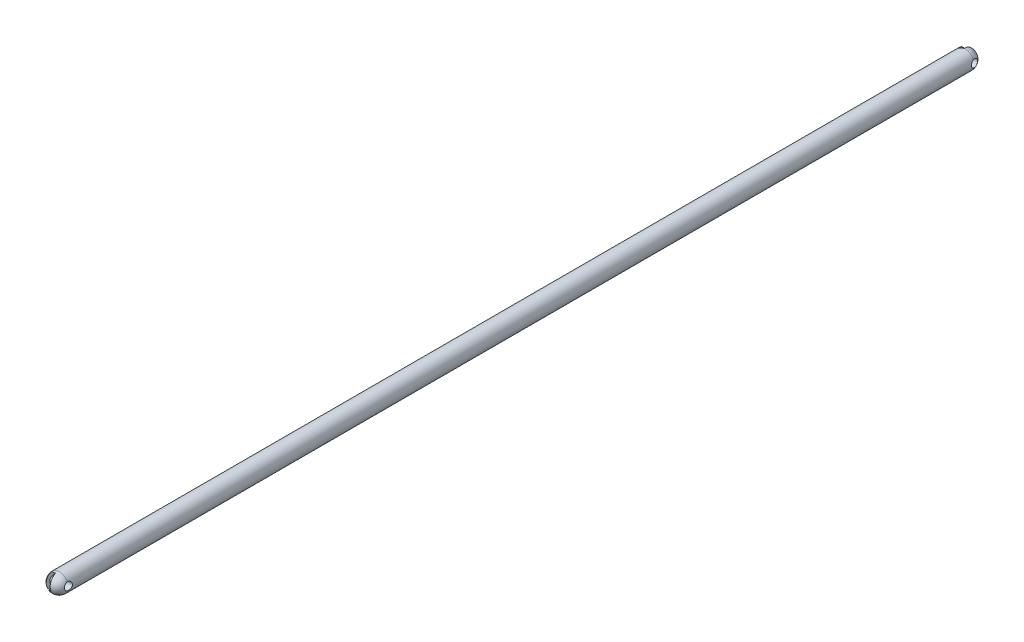
ISO-10303-21;
HEADER;
FILE_DESCRIPTION(('STEP AP214'),'2;1');
FILE_NAME('part.step','',(''),(''),'','','');
FILE_SCHEMA(('AUTOMOTIVE_DESIGN { 1 0 10303 214 1 1 1 1 }'));
ENDSEC;
DATA;
#1=APPLICATION_CONTEXT('core data for automotive mechanical design processes');
#2=APPLICATION_PROTOCOL_DEFINITION('international standard','automotive_design',2000,#1);
#3=PRODUCT_CONTEXT('',#1,'mechanical');
#4=PRODUCT('Part','Part','',(#3));
#5=PRODUCT_RELATED_PRODUCT_CATEGORY('part','',(#4));
#6=PRODUCT_DEFINITION_FORMATION('','',#4);
#7=PRODUCT_DEFINITION_CONTEXT('part definition',#1,'design');
#8=PRODUCT_DEFINITION('design','',#6,#7);
#9=PRODUCT_DEFINITION_SHAPE('','',#8);
#10=(LENGTH_UNIT() NAMED_UNIT(*) SI_UNIT(.MILLI.,.METRE.));
#11=(NAMED_UNIT(*) PLANE_ANGLE_UNIT() SI_UNIT($,.RADIAN.));
#12=(NAMED_UNIT(*) SI_UNIT($,.STERADIAN.) SOLID_ANGLE_UNIT());
#13=UNCERTAINTY_MEASURE_WITH_UNIT(LENGTH_MEASURE(1.E-05),#10,'distance_accuracy_value','');
#14=(GEOMETRIC_REPRESENTATION_CONTEXT(3) GLOBAL_UNCERTAINTY_ASSIGNED_CONTEXT((#13)) GLOBAL_UNIT_ASSIGNED_CONTEXT((#10,
#11,#12)) REPRESENTATION_CONTEXT('',''));
#15=CARTESIAN_POINT('',(0.,0.,0.));
#16=DIRECTION('',(0.,0.,1.));
#17=DIRECTION('',(1.,0.,0.));
#18=AXIS2_PLACEMENT_3D('',#15,#16,#17);
#19=CARTESIAN_POINT('',(0.,0.,-487.405602584974));
#20=DIRECTION('',(0.,0.,1.));
#21=DIRECTION('',(1.,0.,0.));
#22=AXIS2_PLACEMENT_3D('',#19,#20,#21);
#23=SPHERICAL_SURFACE('',#22,5.);
#24=CARTESIAN_POINT('',(0.,0.,-487.405602584974));
#25=DIRECTION('',(0.,0.,1.));
#26=DIRECTION('',(1.,0.,0.));
#27=AXIS2_PLACEMENT_3D('',#24,#25,#26);
#28=CIRCLE('',#27,5.);
#29=CARTESIAN_POINT('',(-4.56594007018859,-2.03769263517494,-487.405602584974));
#30=VERTEX_POINT('',#29);
#31=CARTESIAN_POINT('',(-2.91527036137964,-4.06216675187779,-487.405602584974));
#32=VERTEX_POINT('',#31);
#33=EDGE_CURVE('E157',#30,#32,#28,.T.);
#34=ORIENTED_EDGE('',*,*,#33,.F.);
#35=CARTESIAN_POINT('',(-4.54438160156836,-0.122994973257826,-486.828135619789));
#36=DIRECTION('',(0.991665365521505,0.0268397035739624,-0.126013622823728));
#37=DIRECTION('',(-0.126059035557744,0.,-0.99202274145014));
#38=AXIS2_PLACEMENT_3D('',#35,#36,#37);
#39=CIRCLE('',#38,2.00000000000004);
#40=CARTESIAN_POINT('',(-4.66947630984865,1.787733478951,-487.405602584974));
#41=VERTEX_POINT('',#40);
#42=EDGE_CURVE('E239',#30,#41,#39,.T.);
#43=ORIENTED_EDGE('',*,*,#42,.T.);
#44=CARTESIAN_POINT('',(-3.13072887232831,3.89853007272869,-487.405602584974));
#45=VERTEX_POINT('',#44);
#46=EDGE_CURVE('E164',#45,#41,#28,.T.);
#47=ORIENTED_EDGE('',*,*,#46,.F.);
#48=CARTESIAN_POINT('',(-2.97499609656448,-0.0805191107218875,-487.027561716503));
#49=DIRECTION('',(-0.991665365521505,-0.0268397035739629,0.126013622823729));
#50=DIRECTION('',(0.126059035557745,0.,0.99202274145014));
#51=AXIS2_PLACEMENT_3D('',#48,#49,#50);
#52=CIRCLE('',#51,4.00000000000003);
#53=EDGE_CURVE('E145',#45,#32,#52,.T.);
#54=ORIENTED_EDGE('',*,*,#53,.T.);
#55=EDGE_LOOP('',(#34,#43,#47,#54));
#56=FACE_BOUND('',#55,.T.);
#57=ADVANCED_FACE('F39',(#56),#23,.T.);
#58=CARTESIAN_POINT('',(0.,0.,0.));
#59=DIRECTION('',(0.,0.,1.));
#60=DIRECTION('',(1.,0.,0.));
#61=AXIS2_PLACEMENT_3D('',#58,#59,#60);
#62=SPHERICAL_SURFACE('',#61,5.);
#63=CARTESIAN_POINT('',(-4.56133184862588,-0.401408342217977,0.181997553579467));
#64=DIRECTION('',(0.99536421267338,0.0875944815619359,-0.0397151221702364));
#65=DIRECTION('',(-0.0876636443807125,0.99615013198508,0.));
#66=AXIS2_PLACEMENT_3D('',#63,#64,#65);
#67=CIRCLE('',#66,2.);
#68=CARTESIAN_POINT('',(-4.39393905679713,-2.38606361297279,0.));
#69=VERTEX_POINT('',#68);
#70=CARTESIAN_POINT('',(-4.74313646679556,1.58197865262275,0.));
#71=VERTEX_POINT('',#70);
#72=EDGE_CURVE('E54',#69,#71,#67,.F.);
#73=ORIENTED_EDGE('',*,*,#72,.F.);
#74=CARTESIAN_POINT('',(0.,0.,0.));
#75=DIRECTION('',(0.,0.,1.));
#76=DIRECTION('',(1.,0.,0.));
#77=AXIS2_PLACEMENT_3D('',#74,#75,#76);
#78=CIRCLE('',#77,5.);
#79=CARTESIAN_POINT('',(-2.64031127333073,-4.24602830653808,0.));
#80=VERTEX_POINT('',#79);
#81=EDGE_CURVE('E137',#69,#80,#78,.T.);
#82=ORIENTED_EDGE('',*,*,#81,.T.);
#83=CARTESIAN_POINT('',(-2.98609263802015,-0.262783444685808,0.11914536651071));
#84=DIRECTION('',(-0.995364212673381,-0.0875944815619359,0.0397151221702365));
#85=DIRECTION('',(0.0876636443807125,-0.99615013198508,0.));
#86=AXIS2_PLACEMENT_3D('',#83,#84,#85);
#87=CIRCLE('',#86,4.);
#88=CARTESIAN_POINT('',(-3.31622642739424,3.69699231489883,0.578696903249891));
#89=VERTEX_POINT('',#88);
#90=EDGE_CURVE('E195',#89,#80,#87,.F.);
#91=ORIENTED_EDGE('',*,*,#90,.F.);
#92=CARTESIAN_POINT('',(-0.283684245813847,2.44778637118254,-1.71110056096374));
#93=DIRECTION('',(-0.0945614152712806,0.815928790394163,-0.570366853654567));
#94=DIRECTION('',(0.,0.572934154513705,0.819601399822905));
#95=AXIS2_PLACEMENT_3D('',#92,#93,#94);
#96=CIRCLE('',#95,3.99999999999996);
#97=CARTESIAN_POINT('',(-0.353909354826916,4.73369946071433,1.57061694381502));
#98=VERTEX_POINT('',#97);
#99=EDGE_CURVE('E201',#98,#89,#96,.F.);
#100=ORIENTED_EDGE('',*,*,#99,.F.);
#101=CARTESIAN_POINT('',(0.,0.,0.));
#102=DIRECTION('',(0.99536421267338,0.0875944815619359,-0.0397151221702364));
#103=DIRECTION('',(-0.0876636443807125,0.99615013198508,0.));
#104=AXIS2_PLACEMENT_3D('',#101,#102,#103);
#105=CIRCLE('',#104,5.);
#106=CARTESIAN_POINT('',(0.348372623472996,-1.86038420688369,4.62791606643771));
#107=VERTEX_POINT('',#106);
#108=EDGE_CURVE('E205',#107,#98,#105,.F.);
#109=ORIENTED_EDGE('',*,*,#108,.F.);
#110=CARTESIAN_POINT('',(0.396259002636022,-3.41914434947975,2.39011863260942));
#111=DIRECTION('',(0.0945614152712805,-0.815928790394163,0.570366853654567));
#112=DIRECTION('',(0.,-0.572934154513705,-0.819601399822905));
#113=AXIS2_PLACEMENT_3D('',#110,#111,#112);
#114=CIRCLE('',#113,2.72759301258525);
#115=CARTESIAN_POINT('',(0.444145381799037,-4.9779044920758,0.152321198781133));
#116=VERTEX_POINT('',#115);
#117=EDGE_CURVE('E11',#116,#107,#114,.F.);
#118=ORIENTED_EDGE('',*,*,#117,.F.);
#119=CARTESIAN_POINT('',(0.438318221903555,-4.9807506599254,0.));
#120=VERTEX_POINT('',#119);
#121=EDGE_CURVE('E425',#120,#116,#105,.F.);
#122=ORIENTED_EDGE('',*,*,#121,.F.);
#123=CARTESIAN_POINT('',(4.74313646679558,-1.58197865262271,0.));
#124=VERTEX_POINT('',#123);
#125=EDGE_CURVE('E147',#120,#124,#78,.T.);
#126=ORIENTED_EDGE('',*,*,#125,.T.);
#127=CARTESIAN_POINT('',(4.56133184862589,0.401408342217992,-0.181997553579587));
#128=DIRECTION('',(-0.99536421267338,-0.0875944815619359,0.0397151221702364));
#129=DIRECTION('',(0.0876636443807125,-0.99615013198508,0.));
#130=AXIS2_PLACEMENT_3D('',#127,#128,#129);
#131=CIRCLE('',#130,2.);
#132=CARTESIAN_POINT('',(4.39393905679712,2.38606361297281,0.));
#133=VERTEX_POINT('',#132);
#134=EDGE_CURVE('E61',#133,#124,#131,.F.);
#135=ORIENTED_EDGE('',*,*,#134,.F.);
#136=EDGE_CURVE('E139',#133,#71,#78,.T.);
#137=ORIENTED_EDGE('',*,*,#136,.T.);
#138=EDGE_LOOP('',(#73,#82,#91,#100,#109,#118,#122,#126,#135,#137));
#139=FACE_BOUND('',#138,.T.);
#140=ADVANCED_FACE('F135',(#139),#62,.T.);
#141=CARTESIAN_POINT('',(4.56594007018862,2.03769263517488,-487.405602584974));
#142=VERTEX_POINT('',#141);
#143=CARTESIAN_POINT('',(-0.135276875983171,4.99816968167591,-487.405602584974));
#144=VERTEX_POINT('',#143);
#145=EDGE_CURVE('E153',#142,#144,#28,.T.);
#146=ORIENTED_EDGE('',*,*,#145,.F.);
#147=CARTESIAN_POINT('',(4.5443816015683,0.122994973257891,-487.98306955016));
#148=DIRECTION('',(-0.991665365521505,-0.0268397035739624,0.126013622823728));
#149=DIRECTION('',(0.126059035557744,0.,0.99202274145014));
#150=AXIS2_PLACEMENT_3D('',#147,#148,#149);
#151=CIRCLE('',#150,2.00000000000004);
#152=CARTESIAN_POINT('',(4.66947630984872,-1.78773347895082,-487.405602584974));
#153=VERTEX_POINT('',#152);
#154=EDGE_CURVE('E216',#142,#153,#151,.T.);
#155=ORIENTED_EDGE('',*,*,#154,.T.);
#156=CARTESIAN_POINT('',(0.135276875983353,-4.9981696816759,-487.405602584974));
#157=VERTEX_POINT('',#156);
#158=EDGE_CURVE('E156',#157,#153,#28,.T.);
#159=ORIENTED_EDGE('',*,*,#158,.F.);
#160=CARTESIAN_POINT('',(0.,0.,-487.405602584974));
#161=DIRECTION('',(0.991665365521505,0.0268397035739626,-0.126013622823729));
#162=DIRECTION('',(-0.126059035557745,0.,-0.99202274145014));
#163=AXIS2_PLACEMENT_3D('',#160,#161,#162);
#164=CIRCLE('',#163,5.);
#165=EDGE_CURVE('E149',#157,#144,#164,.T.);
#166=ORIENTED_EDGE('',*,*,#165,.T.);
#167=EDGE_LOOP('',(#146,#155,#159,#166));
#168=FACE_BOUND('',#167,.T.);
#169=ADVANCED_FACE('F41',(#168),#23,.T.);
#170=CARTESIAN_POINT('',(0.,0.,0.));
#171=DIRECTION('',(0.,0.,-1.));
#172=DIRECTION('',(-1.,0.,0.));
#173=AXIS2_PLACEMENT_3D('',#170,#171,#172);
#174=CYLINDRICAL_SURFACE('',#173,5.);
#175=ORIENTED_EDGE('',*,*,#46,.T.);
#176=CARTESIAN_POINT('',(-4.66947630984865,1.787733478951,-487.405602584974));
#177=CARTESIAN_POINT('',(-4.66351751317325,1.80328195546211,-487.355473092111));
#178=CARTESIAN_POINT('',(-4.65826103640564,1.81679400936569,-487.304629087359));
#179=CARTESIAN_POINT('',(-4.64927275894143,1.83968170775629,-487.201893178683));
#180=CARTESIAN_POINT('',(-4.64554076565082,1.84905787475813,-487.150001407997));
#181=CARTESIAN_POINT('',(-4.63973047718485,1.86358780811257,-487.045727606933));
#182=CARTESIAN_POINT('',(-4.63764623531151,1.8687567602249,-486.993348036214));
#183=CARTESIAN_POINT('',(-4.63515230222582,1.87493223416605,-486.888319543519));
#184=CARTESIAN_POINT('',(-4.63474257878847,1.87593883609654,-486.835670626746));
#185=CARTESIAN_POINT('',(-4.63603452526098,1.87275762874213,-486.677886868902));
#186=CARTESIAN_POINT('',(-4.64025233272072,1.86238105140578,-486.572825428322));
#187=CARTESIAN_POINT('',(-4.6547229912429,1.82590224888449,-486.365942960298));
#188=CARTESIAN_POINT('',(-4.66497942118177,1.7997906979253,-486.264123892245));
#189=CARTESIAN_POINT('',(-4.69065990126826,1.73178319679889,-486.062391362308));
#190=CARTESIAN_POINT('',(-4.70625908793918,1.68934532994847,-485.962683489418));
#191=CARTESIAN_POINT('',(-4.7406892204886,1.59016189668879,-485.771245737522));
#192=CARTESIAN_POINT('',(-4.75952199661809,1.53340821877521,-485.679520421289));
#193=CARTESIAN_POINT('',(-4.80035161172534,1.40067713951199,-485.49737909481));
#194=CARTESIAN_POINT('',(-4.82247799646655,1.32336621154518,-485.407959718229));
#195=CARTESIAN_POINT('',(-4.86563610993325,1.15462593128934,-485.243221061638));
#196=CARTESIAN_POINT('',(-4.88666759047015,1.06319339644084,-485.167904968545));
#197=CARTESIAN_POINT('',(-4.92528877283284,0.866965479426091,-485.033143651348));
#198=CARTESIAN_POINT('',(-4.94283629287156,0.762029033332818,-484.973890095212));
#199=CARTESIAN_POINT('',(-4.97171887294017,0.542423329086382,-484.875234363489));
#200=CARTESIAN_POINT('',(-4.98305988580725,0.427763519257526,-484.835813169062));
#201=CARTESIAN_POINT('',(-4.99694922611202,0.20433946911744,-484.781973297842));
#202=CARTESIAN_POINT('',(-5.00026244955644,0.0961297601014254,-484.765451106508));
#203=CARTESIAN_POINT('',(-4.99970541637261,-0.121481400245741,-484.751315278202));
#204=CARTESIAN_POINT('',(-4.99583886948166,-0.230882207110427,-484.75369187844));
#205=CARTESIAN_POINT('',(-4.98175298934448,-0.438247597508656,-484.776213895401));
#206=CARTESIAN_POINT('',(-4.97208022211072,-0.536414676295768,-484.794887227491));
#207=CARTESIAN_POINT('',(-4.94765738414017,-0.728024260712353,-484.847117990362));
#208=CARTESIAN_POINT('',(-4.93290669777691,-0.821466191907856,-484.880677225993));
#209=CARTESIAN_POINT('',(-4.89901850453265,-1.00425422637426,-484.962533425387));
#210=CARTESIAN_POINT('',(-4.87976198907509,-1.09339146910079,-485.011244787776));
#211=CARTESIAN_POINT('',(-4.83869283265533,-1.26279950117306,-485.121332128271));
#212=CARTESIAN_POINT('',(-4.81687919760099,-1.34306681857967,-485.182713038825));
#213=CARTESIAN_POINT('',(-4.77003311903697,-1.5014332155063,-485.323539478201));
#214=CARTESIAN_POINT('',(-4.74490321931283,-1.57841935684434,-485.404205156059));
#215=CARTESIAN_POINT('',(-4.69587811870043,-1.71879882583968,-485.576990863495));
#216=CARTESIAN_POINT('',(-4.67198372399268,-1.78218336118087,-485.669118241704));
#217=CARTESIAN_POINT('',(-4.6261216523557,-1.89820487208058,-485.870046688439));
#218=CARTESIAN_POINT('',(-4.60442843898899,-1.94969560083364,-485.979577695616));
#219=CARTESIAN_POINT('',(-4.56795212546234,-2.03369928159624,-486.206804677417));
#220=CARTESIAN_POINT('',(-4.55316665000801,-2.06621875801753,-486.324497829396));
#221=CARTESIAN_POINT('',(-4.53325809591743,-2.10953097064869,-486.558967555699));
#222=CARTESIAN_POINT('',(-4.5277195228876,-2.1212595390714,-486.675534485442));
#223=CARTESIAN_POINT('',(-4.52607769363093,-2.12476871092717,-486.908967726996));
#224=CARTESIAN_POINT('',(-4.52995777838248,-2.11658453448331,-487.025833145532));
#225=CARTESIAN_POINT('',(-4.54162730566508,-2.09133066048903,-487.1855789469));
#226=CARTESIAN_POINT('',(-4.54560315134113,-2.08269395096339,-487.230222496817));
#227=CARTESIAN_POINT('',(-4.55483567155301,-2.06242525409225,-487.318611810533));
#228=CARTESIAN_POINT('',(-4.56009022416777,-2.05079822716209,-487.36235893282));
#229=CARTESIAN_POINT('',(-4.56594007018861,-2.03769263517491,-487.405602584974));
#230=B_SPLINE_CURVE_WITH_KNOTS('',3,(#176,#177,#178,#179,#180,#181,#182,#183,#184,#185,#186,
#187,#188,#189,#190,#191,#192,#193,#194,#195,#196,#197,#198,#199,#200,#201,#202,#203,#204,#205,
#206,#207,#208,#209,#210,#211,#212,#213,#214,#215,#216,#217,#218,#219,#220,#221,#222,#223,#224,
#225,#226,#227,#228,#229),.UNSPECIFIED.,.F.,.F.,(4,2,2,2,2,2,2,2,2,2,2,2,2,2,2,2,2,2,2,2,2,2,2,
2,2,2,4),(0.,0.158418322446994,0.31681662508936,0.474640628420281,0.632461594518664,
0.947835339339043,1.26339618335958,1.59048803308853,1.91776563480118,2.27690183016923,
2.63611908179547,2.99945084876743,3.3624335204407,3.6891714537465,4.0157406108142,
4.31554797677452,4.61539170298165,4.92428897830402,5.23330673962141,5.57477666127415,
5.91646665453489,6.28350674654473,6.65042053510757,7.00035413891046,7.34966925729409,
7.48650444645409,7.62311409768893),.UNSPECIFIED.);
#231=EDGE_CURVE('E233',#41,#30,#230,.T.);
#232=ORIENTED_EDGE('',*,*,#231,.T.);
#233=ORIENTED_EDGE('',*,*,#33,.T.);
#234=CARTESIAN_POINT('',(0.,0.,-463.598652726891));
#235=DIRECTION('',(-0.991665365521505,-0.0268397035739629,0.126013622823729));
#236=DIRECTION('',(-0.125967493815141,-0.00340934584538545,-0.992028511113889));
#237=AXIS2_PLACEMENT_3D('',#234,#235,#236);
#238=ELLIPSE('',#237,39.6782497634729,5.);
#239=CARTESIAN_POINT('',(-1.98935735714231,-4.5872058276891,-480.230950000838));
#240=VERTEX_POINT('',#239);
#241=EDGE_CURVE('E179',#32,#240,#238,.T.);
#242=ORIENTED_EDGE('',*,*,#241,.T.);
#243=CARTESIAN_POINT('',(0.,0.,-483.709390197709));
#244=DIRECTION('',(0.0875096655632501,0.577529080928381,0.811666322521163));
#245=DIRECTION('',(0.121599125553052,0.802505994855964,-0.584121375131036));
#246=AXIS2_PLACEMENT_3D('',#243,#244,#245);
#247=ELLIPSE('',#246,6.16016688294916,5.);
#248=CARTESIAN_POINT('',(1.0303732803339,-4.89268136129611,-480.339165176914));
#249=VERTEX_POINT('',#248);
#250=EDGE_CURVE('E175',#240,#249,#247,.T.);
#251=ORIENTED_EDGE('',*,*,#250,.T.);
#252=CARTESIAN_POINT('',(0.,0.,-487.405602584975));
#253=DIRECTION('',(0.991665365521505,0.0268397035739626,-0.126013622823729));
#254=DIRECTION('',(-0.125967493815142,-0.00340934584538543,-0.992028511113889));
#255=AXIS2_PLACEMENT_3D('',#252,#253,#254);
#256=ELLIPSE('',#255,39.6782497634728,5.);
#257=EDGE_CURVE('E171',#249,#157,#256,.T.);
#258=ORIENTED_EDGE('',*,*,#257,.T.);
#259=ORIENTED_EDGE('',*,*,#158,.T.);
#260=CARTESIAN_POINT('',(4.66947630984872,-1.78773347895082,-487.405602584974));
#261=CARTESIAN_POINT('',(4.67568062088382,-1.77151669899013,-487.353282404624));
#262=CARTESIAN_POINT('',(4.68263791042543,-1.75310333172486,-487.3017671715));
#263=CARTESIAN_POINT('',(4.69780826903366,-1.71204161116034,-487.2006691208));
#264=CARTESIAN_POINT('',(4.70602081149726,-1.68939503289125,-487.151085503769));
#265=CARTESIAN_POINT('',(4.73211610901038,-1.61548687082584,-487.005979490226));
#266=CARTESIAN_POINT('',(4.75150197850632,-1.55814476426868,-486.913743133287));
#267=CARTESIAN_POINT('',(4.79187881096462,-1.42914215538673,-486.740571421566));
#268=CARTESIAN_POINT('',(4.81286806265096,-1.3574967905573,-486.659624271684));
#269=CARTESIAN_POINT('',(4.85410959173953,-1.2017107084323,-486.510484915751));
#270=CARTESIAN_POINT('',(4.8743614431976,-1.11756290757257,-486.442299990267));
#271=CARTESIAN_POINT('',(4.91255154712641,-0.935810689459344,-486.318079116466));
#272=CARTESIAN_POINT('',(4.9303862404613,-0.837842929127419,-486.262541807989));
#273=CARTESIAN_POINT('',(4.96078966148223,-0.633428384991481,-486.168115192994));
#274=CARTESIAN_POINT('',(4.97335908153846,-0.526982718203069,-486.129223697581));
#275=CARTESIAN_POINT('',(4.99158418857954,-0.309621585828458,-486.069478964166));
#276=CARTESIAN_POINT('',(4.99730233417291,-0.198756171299304,-486.048463283362));
#277=CARTESIAN_POINT('',(5.00118853300798,0.0250311481304409,-486.024544778103));
#278=CARTESIAN_POINT('',(4.99935831906917,0.137952575122626,-486.021637796958));
#279=CARTESIAN_POINT('',(4.98829586562557,0.358813032230299,-486.033822040977));
#280=CARTESIAN_POINT('',(4.97930146574989,0.466796134358989,-486.048342430813));
#281=CARTESIAN_POINT('',(4.95490447927462,0.678434079830232,-486.093988288997));
#282=CARTESIAN_POINT('',(4.93950158104688,0.782088712421119,-486.125114564866));
#283=CARTESIAN_POINT('',(4.90349778880775,0.982950634292097,-486.203342492352));
#284=CARTESIAN_POINT('',(4.8828656541567,1.08011457455699,-486.250540765545));
#285=CARTESIAN_POINT('',(4.83828148782484,1.26494368820422,-486.35972330429));
#286=CARTESIAN_POINT('',(4.8143280796602,1.3526048962514,-486.421713708081));
#287=CARTESIAN_POINT('',(4.76445605189954,1.51913737518053,-486.56148957281));
#288=CARTESIAN_POINT('',(4.73849818652625,1.59760309598084,-486.639744592057));
#289=CARTESIAN_POINT('',(4.68808199719768,1.73999874142009,-486.808863293971));
#290=CARTESIAN_POINT('',(4.66362209830574,1.80394413098339,-486.899713394478));
#291=CARTESIAN_POINT('',(4.62635043401671,1.89697360032806,-487.059951608533));
#292=CARTESIAN_POINT('',(4.61236472934675,1.93058798573677,-487.126475201934));
#293=CARTESIAN_POINT('',(4.58701109896922,1.99006047864745,-487.263357028969));
#294=CARTESIAN_POINT('',(4.57564270704901,2.0159199677503,-487.333714576909));
#295=CARTESIAN_POINT('',(4.56594007018863,2.03769263517487,-487.405602584974));
#296=B_SPLINE_CURVE_WITH_KNOTS('',3,(#260,#261,#262,#263,#264,#265,#266,#267,#268,#269,#270,
#271,#272,#273,#274,#275,#276,#277,#278,#279,#280,#281,#282,#283,#284,#285,#286,#287,#288,#289,
#290,#291,#292,#293,#294,#295),.UNSPECIFIED.,.F.,.F.,(4,2,2,2,2,2,2,2,2,2,2,2,2,2,2,2,2,4),(0.,
0.165261992408329,0.330454843530165,0.659719946271022,0.988638409406604,1.31774394513133,
1.65817125282287,1.99855378111704,2.33580906160666,2.67298692527655,2.99941542659887,
3.32585980312289,3.65430239796088,3.98288152320431,4.32275138523404,4.66225755202576,
4.88925730529925,5.11621659257229),.UNSPECIFIED.);
#297=EDGE_CURVE('E199',#153,#142,#296,.T.);
#298=ORIENTED_EDGE('',*,*,#297,.T.);
#299=ORIENTED_EDGE('',*,*,#145,.T.);
#300=CARTESIAN_POINT('',(-0.115975220622788,4.99865479386213,-487.253604706045));
#301=VERTEX_POINT('',#300);
#302=EDGE_CURVE('E176',#144,#301,#256,.T.);
#303=ORIENTED_EDGE('',*,*,#302,.T.);
#304=CARTESIAN_POINT('',(-2.98579487870582,4.01061453424448,-486.241170262528));
#305=VERTEX_POINT('',#304);
#306=EDGE_CURVE('E181',#301,#305,#247,.T.);
#307=ORIENTED_EDGE('',*,*,#306,.T.);
#308=EDGE_CURVE('E183',#305,#45,#238,.T.);
#309=ORIENTED_EDGE('',*,*,#308,.T.);
#310=EDGE_LOOP('',(#175,#232,#233,#242,#251,#258,#259,#298,#299,#303,#307,#309));
#311=FACE_BOUND('',#310,.T.);
#312=ORIENTED_EDGE('',*,*,#136,.F.);
#313=CARTESIAN_POINT('',(4.39393905679712,2.38606361297281,0.));
#314=CARTESIAN_POINT('',(4.39139610558732,2.39073187192482,-0.053157418705));
#315=CARTESIAN_POINT('',(4.38997625654949,2.39334294249566,-0.106544579116123));
#316=CARTESIAN_POINT('',(4.38936437016314,2.39447265261062,-0.213358491895057));
#317=CARTESIAN_POINT('',(4.39017162715943,2.39299258842434,-0.266785226361193));
#318=CARTESIAN_POINT('',(4.39398625627022,2.38597909125012,-0.373077578375582));
#319=CARTESIAN_POINT('',(4.39698473234108,2.38046204771739,-0.425944590497752));
#320=CARTESIAN_POINT('',(4.40506696265671,2.36547157616758,-0.530940393786217));
#321=CARTESIAN_POINT('',(4.41015079856985,2.35599799320137,-0.583069155957905));
#322=CARTESIAN_POINT('',(4.42831180736427,2.32179692731951,-0.737718378899219));
#323=CARTESIAN_POINT('',(4.44430587638545,2.29127657618527,-0.838685845735766));
#324=CARTESIAN_POINT('',(4.48239622825695,2.21582776053226,-1.03385141854904));
#325=CARTESIAN_POINT('',(4.50449806587543,2.17088617445875,-1.12804326362392));
#326=CARTESIAN_POINT('',(4.55398361016385,2.06513993817823,-1.3122312256571));
#327=CARTESIAN_POINT('',(4.58157678829879,2.00365214576183,-1.40177926446272));
#328=CARTESIAN_POINT('',(4.63880177646305,1.86734503184674,-1.56936131039325));
#329=CARTESIAN_POINT('',(4.66843431619347,1.79252092311502,-1.64739116447643));
#330=CARTESIAN_POINT('',(4.72909144223346,1.62603649862282,-1.79442027991845));
#331=CARTESIAN_POINT('',(4.76009253271409,1.53363414178498,-1.86259389974705));
#332=CARTESIAN_POINT('',(4.81890248426452,1.33740303689892,-1.98172966057061));
#333=CARTESIAN_POINT('',(4.84671236731633,1.23357796794789,-2.03269732197313));
#334=CARTESIAN_POINT('',(4.89571649440678,1.02143849780935,-2.11373490536048));
#335=CARTESIAN_POINT('',(4.91712654342848,0.913457364397714,-2.14454267473231));
#336=CARTESIAN_POINT('',(4.95304498103723,0.692691480942837,-2.18689871414286));
#337=CARTESIAN_POINT('',(4.96755738080721,0.579909564376371,-2.19845818743947));
#338=CARTESIAN_POINT('',(4.9879795843304,0.36208676975346,-2.20162699457446));
#339=CARTESIAN_POINT('',(4.99446552544104,0.257118185494442,-2.19470332953636));
#340=CARTESIAN_POINT('',(5.00083512713577,0.0494187054348641,-2.16429347200144));
#341=CARTESIAN_POINT('',(5.00071898438955,-0.0533122569310878,-2.1408077728922));
#342=CARTESIAN_POINT('',(4.99459619273007,-0.252751654539705,-2.07853824148996));
#343=CARTESIAN_POINT('',(4.98864428404713,-0.349507178125119,-2.03989857553761));
#344=CARTESIAN_POINT('',(4.97209484203958,-0.535747626475109,-1.94865160199904));
#345=CARTESIAN_POINT('',(4.9614960657051,-0.625230598277765,-1.89604055863695));
#346=CARTESIAN_POINT('',(4.93630734890655,-0.800785301903866,-1.77434931486172));
#347=CARTESIAN_POINT('',(4.9214967329222,-0.886221710181287,-1.70439875593475));
#348=CARTESIAN_POINT('',(4.89028213932747,-1.04483897646766,-1.55202025656632));
#349=CARTESIAN_POINT('',(4.87387735218254,-1.11801355588369,-1.46958596478319));
#350=CARTESIAN_POINT('',(4.84058323069284,-1.25459579782591,-1.28842560139646));
#351=CARTESIAN_POINT('',(4.82372968652759,-1.31708331471021,-1.18899591103396));
#352=CARTESIAN_POINT('',(4.79321697384884,-1.424145774993,-0.980424969356199));
#353=CARTESIAN_POINT('',(4.77955707685722,-1.46872480502734,-0.871285940619388));
#354=CARTESIAN_POINT('',(4.75892462368809,-1.53417093636128,-0.658857806873899));
#355=CARTESIAN_POINT('',(4.75137829632576,-1.55711997173565,-0.556262956370084));
#356=CARTESIAN_POINT('',(4.74174294164794,-1.58623000615382,-0.348579135921558));
#357=CARTESIAN_POINT('',(4.73964149692694,-1.59242920566282,-0.243496393540347));
#358=CARTESIAN_POINT('',(4.74059675610077,-1.58957129101603,-0.115598687368954));
#359=CARTESIAN_POINT('',(4.74091145900438,-1.58863408240334,-0.0924244500052233));
#360=CARTESIAN_POINT('',(4.74181788293069,-1.58592797073484,-0.0461550120719066));
#361=CARTESIAN_POINT('',(4.74240930549396,-1.58415996373808,-0.0230597532868308));
#362=CARTESIAN_POINT('',(4.74313646679573,-1.5819786526227,0.));
#363=B_SPLINE_CURVE_WITH_KNOTS('',3,(#313,#314,#315,#316,#317,#318,#319,#320,#321,#322,#323,
#324,#325,#326,#327,#328,#329,#330,#331,#332,#333,#334,#335,#336,#337,#338,#339,#340,#341,#342,
#343,#344,#345,#346,#347,#348,#349,#350,#351,#352,#353,#354,#355,#356,#357,#358,#359,#360,#361,
#362),.UNSPECIFIED.,.F.,.F.,(4,2,2,2,2,2,2,2,2,2,2,2,2,2,2,2,2,2,2,2,2,2,2,2,4),(0.,
0.160209100260411,0.320367444339012,0.479879154951688,0.639397113074714,0.957886111834062,
1.27666572213482,1.61145006245025,1.94635482060006,2.3014066021716,2.65634435943492,
2.9974320481471,3.33832114105999,3.6529734710734,3.96761642790306,4.2793359562987,
4.59113891876397,4.92393535317822,5.25690167663759,5.61109667151044,5.96521079470938,
6.2800395663162,6.5941497161098,6.66372701111991,6.73322943505652),.UNSPECIFIED.);
#364=EDGE_CURVE('E140',#133,#124,#363,.T.);
#365=ORIENTED_EDGE('',*,*,#364,.T.);
#366=ORIENTED_EDGE('',*,*,#125,.F.);
#367=CARTESIAN_POINT('',(0.,0.,1.74716670243745E-13));
#368=DIRECTION('',(0.99536421267338,0.0875944815619359,-0.0397151221702364));
#369=DIRECTION('',(-0.0395622241916846,-0.00348157234646816,-0.999211043309172));
#370=AXIS2_PLACEMENT_3D('',#367,#368,#369);
#371=ELLIPSE('',#370,125.896628960823,5.);
#372=CARTESIAN_POINT('',(-0.05489144863582,-4.99969868380751,-12.4029077794718));
#373=VERTEX_POINT('',#372);
#374=EDGE_CURVE('E186',#120,#373,#371,.T.);
#375=ORIENTED_EDGE('',*,*,#374,.T.);
#376=CARTESIAN_POINT('',(0.,0.,-5.25977268976601));
#377=DIRECTION('',(-0.0945614152712806,0.815928790394163,-0.570366853654567));
#378=DIRECTION('',(0.0656627084610995,-0.566574581556006,-0.821390073139546));
#379=AXIS2_PLACEMENT_3D('',#376,#377,#378);
#380=ELLIPSE('',#379,8.76628781627651,5.);
#381=CARTESIAN_POINT('',(-3.08169145701643,-3.93740749272314,-10.3814500952886));
#382=VERTEX_POINT('',#381);
#383=EDGE_CURVE('E188',#373,#382,#380,.T.);
#384=ORIENTED_EDGE('',*,*,#383,.T.);
#385=CARTESIAN_POINT('',(0.,0.,75.5379773764937));
#386=DIRECTION('',(-0.995364212673381,-0.0875944815619359,0.0397151221702365));
#387=DIRECTION('',(-0.0395622241916846,-0.00348157234646816,-0.999211043309172));
#388=AXIS2_PLACEMENT_3D('',#385,#386,#387);
#389=ELLIPSE('',#388,125.896628960823,5.);
#390=EDGE_CURVE('E48',#382,#80,#389,.T.);
#391=ORIENTED_EDGE('',*,*,#390,.T.);
#392=ORIENTED_EDGE('',*,*,#81,.F.);
#393=CARTESIAN_POINT('',(-4.39393905679713,-2.38606361297279,0.));
#394=CARTESIAN_POINT('',(-4.39649700931138,-2.38133957993088,-0.0539534896360281));
#395=CARTESIAN_POINT('',(-4.40020948297846,-2.37449823792519,-0.107658514661384));
#396=CARTESIAN_POINT('',(-4.40978833264369,-2.35666847780249,-0.21415829722019));
#397=CARTESIAN_POINT('',(-4.4156537995551,-2.34568180996655,-0.266953429113531));
#398=CARTESIAN_POINT('',(-4.42936089249785,-2.31969225185691,-0.371076201754642));
#399=CARTESIAN_POINT('',(-4.43719523963018,-2.30470414236199,-0.422408488928098));
#400=CARTESIAN_POINT('',(-4.45462801980945,-2.27082633240458,-0.523448633493214));
#401=CARTESIAN_POINT('',(-4.46422658851172,-2.25193633190224,-0.573156365622418));
#402=CARTESIAN_POINT('',(-4.49527613529388,-2.18966835116543,-0.71923923080476));
#403=CARTESIAN_POINT('',(-4.51901178850232,-2.14063661654237,-0.812795820888194));
#404=CARTESIAN_POINT('',(-4.57030739936172,-2.02880899197197,-0.990130925893849));
#405=CARTESIAN_POINT('',(-4.59787084227951,-1.96600052753296,-1.07390040002234));
#406=CARTESIAN_POINT('',(-4.65585590352299,-1.82458698117461,-1.23379033570582));
#407=CARTESIAN_POINT('',(-4.68635139849088,-1.74535830500903,-1.30933426761386));
#408=CARTESIAN_POINT('',(-4.74632798193247,-1.57496693711642,-1.44600373721275));
#409=CARTESIAN_POINT('',(-4.77580902265812,-1.48380368462392,-1.50712859702168));
#410=CARTESIAN_POINT('',(-4.83190091900439,-1.28962616550146,-1.61437377613545));
#411=CARTESIAN_POINT('',(-4.85844215996711,-1.18641049750258,-1.6601677518453));
#412=CARTESIAN_POINT('',(-4.90574823055474,-0.972428551738519,-1.73342045420983));
#413=CARTESIAN_POINT('',(-4.92651538625068,-0.861665336932217,-1.7608865704426));
#414=CARTESIAN_POINT('',(-4.95985461123089,-0.641571101746434,-1.79551540302481));
#415=CARTESIAN_POINT('',(-4.97278205402776,-0.532441520678197,-1.80361756187446));
#416=CARTESIAN_POINT('',(-4.99135483200108,-0.313712200166463,-1.80196070144771));
#417=CARTESIAN_POINT('',(-4.99700157124009,-0.204112555464956,-1.79220512686174));
#418=CARTESIAN_POINT('',(-5.00108629305633,0.00853274373356007,-1.75586094728833));
#419=CARTESIAN_POINT('',(-4.99976231644852,0.111674605748063,-1.72985458602816));
#420=CARTESIAN_POINT('',(-4.99123633446751,0.312525773905057,-1.66243305637198));
#421=CARTESIAN_POINT('',(-4.98403341923899,0.410234236645878,-1.62101550339917));
#422=CARTESIAN_POINT('',(-4.9647313210517,0.600750036128035,-1.52246245151446));
#423=CARTESIAN_POINT('',(-4.9524862551405,0.693309020301591,-1.46487648329054));
#424=CARTESIAN_POINT('',(-4.92489153154791,0.867911040321666,-1.33606622920515));
#425=CARTESIAN_POINT('',(-4.90954048120346,0.949949331838911,-1.26483582621013));
#426=CARTESIAN_POINT('',(-4.87692919970299,1.1055380776812,-1.10622587867564));
#427=CARTESIAN_POINT('',(-4.85961091655212,1.17840905073403,-1.01819092624479));
#428=CARTESIAN_POINT('',(-4.82632031536268,1.30810178609965,-0.830763763174026));
#429=CARTESIAN_POINT('',(-4.81034691446615,1.3649365486805,-0.731380844480344));
#430=CARTESIAN_POINT('',(-4.78959945376644,1.43537136397091,-0.578516523756888));
#431=CARTESIAN_POINT('',(-4.78335233272814,1.45599297511721,-0.528370368613649));
#432=CARTESIAN_POINT('',(-4.77192887046978,1.49300704700443,-0.426411787772438));
#433=CARTESIAN_POINT('',(-4.76675239899256,1.50940002226885,-0.374599565658455));
#434=CARTESIAN_POINT('',(-4.75765813855854,1.53782887432905,-0.269502301616986));
#435=CARTESIAN_POINT('',(-4.75374453231819,1.54985028849737,-0.216212987530467));
#436=CARTESIAN_POINT('',(-4.74733823800709,1.56935252518696,-0.108700620850644));
#437=CARTESIAN_POINT('',(-4.74484622659381,1.57683118553623,-0.0544771362353011));
#438=CARTESIAN_POINT('',(-4.74313646679557,1.58197865262274,0.));
#439=B_SPLINE_CURVE_WITH_KNOTS('',3,(#393,#394,#395,#396,#397,#398,#399,#400,#401,#402,#403,
#404,#405,#406,#407,#408,#409,#410,#411,#412,#413,#414,#415,#416,#417,#418,#419,#420,#421,#422,
#423,#424,#425,#426,#427,#428,#429,#430,#431,#432,#433,#434,#435,#436,#437,#438),.UNSPECIFIED.,
.F.,.F.,(4,2,2,2,2,2,2,2,2,2,2,2,2,2,2,2,2,2,2,2,2,2,4),(0.,0.162594557998196,0.325120540377744,
0.487054286998294,0.649000490316514,0.972209246840506,1.29571424377496,1.63508317235682,
1.97446805246656,2.32067568186832,2.66674363993495,2.99564731815458,3.32448755876246,
3.64217273204987,3.9599070812829,4.28756410326637,4.61536836716984,4.96053061746359,
5.30541224163578,5.46898864186673,5.63254512937736,5.79663789834917,5.96080870794664),.UNSPECIFIED.);
#440=EDGE_CURVE('E125',#69,#71,#439,.T.);
#441=ORIENTED_EDGE('',*,*,#440,.T.);
#442=EDGE_LOOP('',(#312,#365,#366,#375,#384,#391,#392,#441));
#443=FACE_BOUND('',#442,.T.);
#444=ADVANCED_FACE('F143',(#311,#443),#174,.T.);
#445=CARTESIAN_POINT('',(27.2507701123229,-231.136933410655,-322.185385437771));
#446=DIRECTION('',(0.0875096655632501,0.577529080928381,0.811666322521163));
#447=DIRECTION('',(0.,-0.814792133616051,0.579753205249788));
#448=AXIS2_PLACEMENT_3D('',#445,#446,#447);
#449=PLANE('',#448);
#450=DIRECTION('',(-0.0945614152712805,0.815928790394163,-0.570366853654567));
#451=VECTOR('',#450,1.);
#452=CARTESIAN_POINT('',(27.2507701123229,-231.136933410655,-322.185385437771));
#453=LINE('',#452,#451);
#454=EDGE_CURVE('E242',#249,#301,#453,.T.);
#455=ORIENTED_EDGE('',*,*,#454,.F.);
#456=ORIENTED_EDGE('',*,*,#250,.F.);
#457=DIRECTION('',(-0.0945614152712805,0.815928790394163,-0.570366853654567));
#458=VECTOR('',#457,1.);
#459=CARTESIAN_POINT('',(24.2757740157583,-231.217452521377,-321.8073445693));
#460=LINE('',#459,#458);
#461=EDGE_CURVE('E243',#240,#305,#460,.T.);
#462=ORIENTED_EDGE('',*,*,#461,.T.);
#463=ORIENTED_EDGE('',*,*,#306,.F.);
#464=EDGE_LOOP('',(#455,#456,#462,#463));
#465=FACE_BOUND('',#464,.T.);
#466=ADVANCED_FACE('F255',(#465),#449,.F.);
#467=CARTESIAN_POINT('',(24.2757740157583,-231.217452521377,-321.8073445693));
#468=DIRECTION('',(-0.991665365521505,-0.0268397035739629,0.126013622823729));
#469=DIRECTION('',(0.126059035557745,0.,0.99202274145014));
#470=AXIS2_PLACEMENT_3D('',#467,#468,#469);
#471=PLANE('',#470);
#472=CARTESIAN_POINT('',(-2.9749960965645,-0.0805191107218535,-487.027561716503));
#473=DIRECTION('',(-0.991665365521505,-0.0268397035739629,0.126013622823729));
#474=DIRECTION('',(0.126059035557745,0.,0.99202274145014));
#475=AXIS2_PLACEMENT_3D('',#472,#473,#474);
#476=CIRCLE('',#475,2.00000000000004);
#477=CARTESIAN_POINT('',(-2.72287802544901,-0.0805191107218535,-485.043516233603));
#478=VERTEX_POINT('',#477);
#479=EDGE_CURVE('E194',#478,#478,#476,.T.);
#480=ORIENTED_EDGE('',*,*,#479,.T.);
#481=EDGE_LOOP('',(#480));
#482=FACE_BOUND('',#481,.T.);
#483=ORIENTED_EDGE('',*,*,#53,.F.);
#484=ORIENTED_EDGE('',*,*,#308,.F.);
#485=ORIENTED_EDGE('',*,*,#461,.F.);
#486=ORIENTED_EDGE('',*,*,#241,.F.);
#487=EDGE_LOOP('',(#483,#484,#485,#486));
#488=FACE_BOUND('',#487,.T.);
#489=ADVANCED_FACE('F230',(#482,#488),#471,.F.);
#490=CARTESIAN_POINT('',(26.5506848143187,-235.757218680007,-328.678789973428));
#491=DIRECTION('',(0.991665365521505,0.0268397035739626,-0.126013622823729));
#492=DIRECTION('',(-0.126059035557745,0.,-0.99202274145014));
#493=AXIS2_PLACEMENT_3D('',#490,#491,#492);
#494=PLANE('',#493);
#495=CARTESIAN_POINT('',(0.,0.,-487.405602584974));
#496=DIRECTION('',(0.991665365521505,0.0268397035739626,-0.126013622823729));
#497=DIRECTION('',(-0.126059035557745,0.,-0.99202274145014));
#498=AXIS2_PLACEMENT_3D('',#495,#496,#497);
#499=CIRCLE('',#498,2.00000000000004);
#500=CARTESIAN_POINT('',(-0.25211807111543,0.,-489.389648067875));
#501=VERTEX_POINT('',#500);
#502=EDGE_CURVE('E191',#501,#501,#499,.T.);
#503=ORIENTED_EDGE('',*,*,#502,.T.);
#504=EDGE_LOOP('',(#503));
#505=FACE_BOUND('',#504,.T.);
#506=ORIENTED_EDGE('',*,*,#165,.F.);
#507=ORIENTED_EDGE('',*,*,#257,.F.);
#508=ORIENTED_EDGE('',*,*,#454,.T.);
#509=ORIENTED_EDGE('',*,*,#302,.F.);
#510=EDGE_LOOP('',(#506,#507,#508,#509));
#511=FACE_BOUND('',#510,.T.);
#512=ADVANCED_FACE('F252',(#505,#511),#494,.F.);
#513=CARTESIAN_POINT('',(5.67489773484121,0.153592712129885,-488.126727318765));
#514=DIRECTION('',(-0.991665365521505,-0.0268397035739624,0.12601362282373));
#515=DIRECTION('',(0.126059035557746,0.,0.99202274145014));
#516=AXIS2_PLACEMENT_3D('',#513,#514,#515);
#517=CYLINDRICAL_SURFACE('',#516,2.00000000000004);
#518=ORIENTED_EDGE('',*,*,#502,.F.);
#519=EDGE_LOOP('',(#518));
#520=FACE_BOUND('',#519,.T.);
#521=ORIENTED_EDGE('',*,*,#297,.F.);
#522=ORIENTED_EDGE('',*,*,#154,.F.);
#523=EDGE_LOOP('',(#521,#522));
#524=FACE_BOUND('',#523,.T.);
#525=ADVANCED_FACE('F226',(#520,#524),#517,.F.);
#526=ORIENTED_EDGE('',*,*,#479,.F.);
#527=EDGE_LOOP('',(#526));
#528=FACE_BOUND('',#527,.T.);
#529=ORIENTED_EDGE('',*,*,#231,.F.);
#530=ORIENTED_EDGE('',*,*,#42,.F.);
#531=EDGE_LOOP('',(#529,#530));
#532=FACE_BOUND('',#531,.T.);
#533=ADVANCED_FACE('F220',(#528,#532),#517,.F.);
#534=CARTESIAN_POINT('',(3.87438487044016,-230.366189906669,-335.44862007495));
#535=DIRECTION('',(-0.0945614152712806,0.815928790394163,-0.570366853654567));
#536=DIRECTION('',(0.,0.572934154513705,0.819601399822905));
#537=AXIS2_PLACEMENT_3D('',#534,#535,#536);
#538=PLANE('',#537);
#539=ORIENTED_EDGE('',*,*,#99,.T.);
#540=DIRECTION('',(-0.017556277253267,0.571478272382961,0.820429376194681));
#541=VECTOR('',#540,1.);
#542=CARTESIAN_POINT('',(3.87438487044016,-230.366189906669,-335.44862007495));
#543=LINE('',#542,#541);
#544=EDGE_CURVE('E423',#382,#89,#543,.T.);
#545=ORIENTED_EDGE('',*,*,#544,.F.);
#546=ORIENTED_EDGE('',*,*,#383,.F.);
#547=DIRECTION('',(-0.017556277253267,0.571478272382961,0.820429376194681));
#548=VECTOR('',#547,1.);
#549=CARTESIAN_POINT('',(6.8604775084603,-230.103406461984,-335.56776544146));
#550=LINE('',#549,#548);
#551=EDGE_CURVE('E426',#373,#98,#550,.T.);
#552=ORIENTED_EDGE('',*,*,#551,.T.);
#553=EDGE_LOOP('',(#539,#545,#546,#552));
#554=FACE_BOUND('',#553,.T.);
#555=ADVANCED_FACE('F225',(#554),#538,.F.);
#556=CARTESIAN_POINT('',(4.55432811889002,-236.233120627332,-331.347400881377));
#557=DIRECTION('',(-0.995364212673381,-0.0875944815619359,0.0397151221702365));
#558=DIRECTION('',(0.0876636443807125,-0.99615013198508,0.));
#559=AXIS2_PLACEMENT_3D('',#556,#557,#558);
#560=PLANE('',#559);
#561=CARTESIAN_POINT('',(-2.98609263802015,-0.262783444685802,0.119145366510649));
#562=DIRECTION('',(-0.995364212673381,-0.0875944815619359,0.0397151221702365));
#563=DIRECTION('',(0.0876636443807125,-0.99615013198508,0.));
#564=AXIS2_PLACEMENT_3D('',#561,#562,#563);
#565=CIRCLE('',#564,2.);
#566=CARTESIAN_POINT('',(-2.81076534925873,-2.25508370865596,0.119145366510649));
#567=VERTEX_POINT('',#566);
#568=EDGE_CURVE('E132',#567,#567,#565,.T.);
#569=ORIENTED_EDGE('',*,*,#568,.T.);
#570=EDGE_LOOP('',(#569));
#571=FACE_BOUND('',#570,.T.);
#572=ORIENTED_EDGE('',*,*,#90,.T.);
#573=ORIENTED_EDGE('',*,*,#390,.F.);
#574=ORIENTED_EDGE('',*,*,#544,.T.);
#575=EDGE_LOOP('',(#572,#573,#574));
#576=FACE_BOUND('',#575,.T.);
#577=ADVANCED_FACE('F228',(#571,#576),#560,.F.);
#578=CARTESIAN_POINT('',(7.54042075691017,-235.970337182646,-331.466546247887));
#579=DIRECTION('',(0.99536421267338,0.0875944815619359,-0.0397151221702364));
#580=DIRECTION('',(-0.0876636443807125,0.99615013198508,0.));
#581=AXIS2_PLACEMENT_3D('',#578,#579,#580);
#582=PLANE('',#581);
#583=CARTESIAN_POINT('',(0.,0.,0.));
#584=DIRECTION('',(0.99536421267338,0.0875944815619359,-0.0397151221702364));
#585=DIRECTION('',(-0.0876636443807125,0.99615013198508,0.));
#586=AXIS2_PLACEMENT_3D('',#583,#584,#585);
#587=CIRCLE('',#586,2.);
#588=CARTESIAN_POINT('',(-0.175327288761436,1.99230026397017,0.));
#589=VERTEX_POINT('',#588);
#590=EDGE_CURVE('E43',#589,#589,#587,.T.);
#591=ORIENTED_EDGE('',*,*,#590,.T.);
#592=EDGE_LOOP('',(#591));
#593=FACE_BOUND('',#592,.T.);
#594=ORIENTED_EDGE('',*,*,#108,.T.);
#595=ORIENTED_EDGE('',*,*,#551,.F.);
#596=ORIENTED_EDGE('',*,*,#374,.F.);
#597=ORIENTED_EDGE('',*,*,#121,.T.);
#598=DIRECTION('',(-0.017556277253267,0.571478272382961,0.820429376194681));
#599=VECTOR('',#598,1.);
#600=CARTESIAN_POINT('',(7.54042075691017,-235.970337182646,-331.466546247887));
#601=LINE('',#600,#599);
#602=EDGE_CURVE('E422',#116,#107,#601,.T.);
#603=ORIENTED_EDGE('',*,*,#602,.T.);
#604=EDGE_LOOP('',(#594,#595,#596,#597,#603));
#605=FACE_BOUND('',#604,.T.);
#606=ADVANCED_FACE('F300',(#593,#605),#582,.F.);
#607=CARTESIAN_POINT('',(4.55432811889002,-236.233120627332,-331.347400881377));
#608=DIRECTION('',(0.0945614152712805,-0.815928790394163,0.570366853654567));
#609=DIRECTION('',(0.,-0.572934154513705,-0.819601399822905));
#610=AXIS2_PLACEMENT_3D('',#607,#608,#609);
#611=PLANE('',#610);
#612=ORIENTED_EDGE('',*,*,#117,.T.);
#613=ORIENTED_EDGE('',*,*,#602,.F.);
#614=EDGE_LOOP('',(#612,#613));
#615=FACE_BOUND('',#614,.T.);
#616=ADVANCED_FACE('F307',(#615),#611,.F.);
#617=CARTESIAN_POINT('',(24.8549830852213,2.18729921154506,-0.991716074578922));
#618=DIRECTION('',(-0.99536421267338,-0.0875944815619359,0.0397151221702364));
#619=DIRECTION('',(0.0876636443807125,-0.99615013198508,0.));
#620=AXIS2_PLACEMENT_3D('',#617,#618,#619);
#621=CYLINDRICAL_SURFACE('',#620,2.);
#622=ORIENTED_EDGE('',*,*,#134,.T.);
#623=ORIENTED_EDGE('',*,*,#364,.F.);
#624=EDGE_LOOP('',(#622,#623));
#625=FACE_BOUND('',#624,.T.);
#626=ORIENTED_EDGE('',*,*,#590,.F.);
#627=EDGE_LOOP('',(#626));
#628=FACE_BOUND('',#627,.T.);
#629=ADVANCED_FACE('F315',(#625,#628),#621,.F.);
#630=ORIENTED_EDGE('',*,*,#72,.T.);
#631=ORIENTED_EDGE('',*,*,#440,.F.);
#632=EDGE_LOOP('',(#630,#631));
#633=FACE_BOUND('',#632,.T.);
#634=ORIENTED_EDGE('',*,*,#568,.F.);
#635=EDGE_LOOP('',(#634));
#636=FACE_BOUND('',#635,.T.);
#637=ADVANCED_FACE('F126',(#633,#636),#621,.F.);
#638=CLOSED_SHELL('',(#57,#140,#169,#444,#466,#489,#512,#525,#533,#555,#577,#606,#616,#629,#637));
#639=MANIFOLD_SOLID_BREP('B2',#638);
#640=ADVANCED_BREP_SHAPE_REPRESENTATION('',(#18,#639),#14);
#641=SHAPE_DEFINITION_REPRESENTATION(#9,#640);
ENDSEC;
END-ISO-10303-21;
